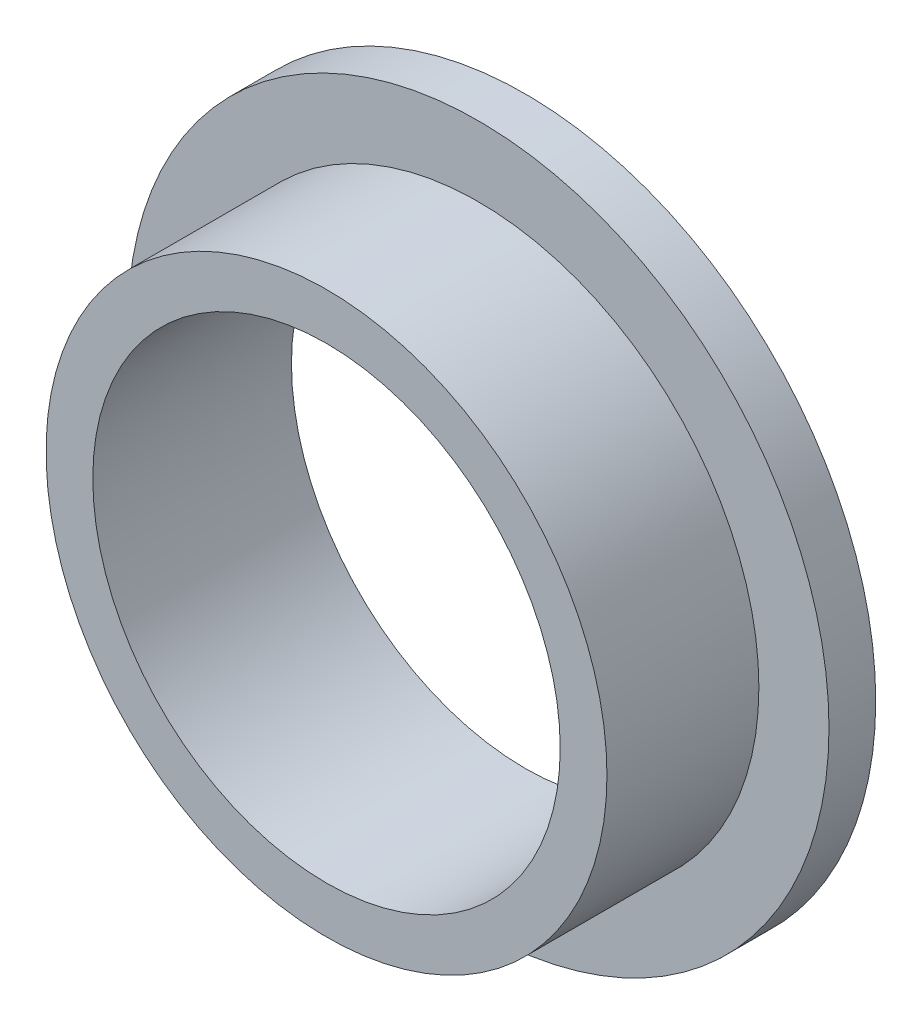
ISO-10303-21;
HEADER;
FILE_DESCRIPTION(('STEP AP214'),'2;1');
FILE_NAME('part.step','',(''),(''),'','','');
FILE_SCHEMA(('AUTOMOTIVE_DESIGN { 1 0 10303 214 1 1 1 1 }'));
ENDSEC;
DATA;
#1=APPLICATION_CONTEXT('core data for automotive mechanical design processes');
#2=APPLICATION_PROTOCOL_DEFINITION('international standard','automotive_design',2000,#1);
#3=PRODUCT_CONTEXT('',#1,'mechanical');
#4=PRODUCT('Part','Part','',(#3));
#5=PRODUCT_RELATED_PRODUCT_CATEGORY('part','',(#4));
#6=PRODUCT_DEFINITION_FORMATION('','',#4);
#7=PRODUCT_DEFINITION_CONTEXT('part definition',#1,'design');
#8=PRODUCT_DEFINITION('design','',#6,#7);
#9=PRODUCT_DEFINITION_SHAPE('','',#8);
#10=(LENGTH_UNIT() NAMED_UNIT(*) SI_UNIT(.MILLI.,.METRE.));
#11=(NAMED_UNIT(*) PLANE_ANGLE_UNIT() SI_UNIT($,.RADIAN.));
#12=(NAMED_UNIT(*) SI_UNIT($,.STERADIAN.) SOLID_ANGLE_UNIT());
#13=UNCERTAINTY_MEASURE_WITH_UNIT(LENGTH_MEASURE(1.E-05),#10,'distance_accuracy_value','');
#14=(GEOMETRIC_REPRESENTATION_CONTEXT(3) GLOBAL_UNCERTAINTY_ASSIGNED_CONTEXT((#13)) GLOBAL_UNIT_ASSIGNED_CONTEXT((#10,
#11,#12)) REPRESENTATION_CONTEXT('',''));
#15=CARTESIAN_POINT('',(0.,0.,0.));
#16=DIRECTION('',(0.,0.,1.));
#17=DIRECTION('',(1.,0.,0.));
#18=AXIS2_PLACEMENT_3D('',#15,#16,#17);
#19=CARTESIAN_POINT('',(0.,30.,0.));
#20=DIRECTION('',(0.,0.,1.));
#21=DIRECTION('',(1.,0.,0.));
#22=AXIS2_PLACEMENT_3D('',#19,#20,#21);
#23=PLANE('',#22);
#24=CARTESIAN_POINT('',(0.,0.,0.));
#25=DIRECTION('',(0.,0.,1.));
#26=DIRECTION('',(1.,0.,0.));
#27=AXIS2_PLACEMENT_3D('',#24,#25,#26);
#28=CIRCLE('',#27,45.);
#29=CARTESIAN_POINT('',(45.,0.,0.));
#30=VERTEX_POINT('',#29);
#31=EDGE_CURVE('E55',#30,#30,#28,.T.);
#32=ORIENTED_EDGE('',*,*,#31,.F.);
#33=EDGE_LOOP('',(#32));
#34=FACE_BOUND('',#33,.T.);
#35=CARTESIAN_POINT('',(0.,0.,0.));
#36=DIRECTION('',(0.,0.,1.));
#37=DIRECTION('',(1.,0.,0.));
#38=AXIS2_PLACEMENT_3D('',#35,#36,#37);
#39=CIRCLE('',#38,30.);
#40=CARTESIAN_POINT('',(30.,0.,0.));
#41=VERTEX_POINT('',#40);
#42=EDGE_CURVE('E10',#41,#41,#39,.T.);
#43=ORIENTED_EDGE('',*,*,#42,.T.);
#44=EDGE_LOOP('',(#43));
#45=FACE_BOUND('',#44,.T.);
#46=ADVANCED_FACE('F33',(#34,#45),#23,.F.);
#47=CARTESIAN_POINT('',(0.,0.,30.7627118644068));
#48=DIRECTION('',(0.,0.,1.));
#49=DIRECTION('',(1.,0.,0.));
#50=AXIS2_PLACEMENT_3D('',#47,#48,#49);
#51=CYLINDRICAL_SURFACE('',#50,30.);
#52=ORIENTED_EDGE('',*,*,#42,.F.);
#53=EDGE_LOOP('',(#52));
#54=FACE_BOUND('',#53,.T.);
#55=CARTESIAN_POINT('',(0.,0.,25.5));
#56=DIRECTION('',(0.,0.,1.));
#57=DIRECTION('',(1.,0.,0.));
#58=AXIS2_PLACEMENT_3D('',#55,#56,#57);
#59=CIRCLE('',#58,30.);
#60=CARTESIAN_POINT('',(30.,0.,25.5));
#61=VERTEX_POINT('',#60);
#62=EDGE_CURVE('E39',#61,#61,#59,.T.);
#63=ORIENTED_EDGE('',*,*,#62,.T.);
#64=EDGE_LOOP('',(#63));
#65=FACE_BOUND('',#64,.T.);
#66=ADVANCED_FACE('F62',(#54,#65),#51,.F.);
#67=CARTESIAN_POINT('',(0.,36.,25.5));
#68=DIRECTION('',(0.,0.,-1.));
#69=DIRECTION('',(-1.,0.,0.));
#70=AXIS2_PLACEMENT_3D('',#67,#68,#69);
#71=PLANE('',#70);
#72=ORIENTED_EDGE('',*,*,#62,.F.);
#73=EDGE_LOOP('',(#72));
#74=FACE_BOUND('',#73,.T.);
#75=CARTESIAN_POINT('',(0.,0.,25.5));
#76=DIRECTION('',(0.,0.,1.));
#77=DIRECTION('',(1.,0.,0.));
#78=AXIS2_PLACEMENT_3D('',#75,#76,#77);
#79=CIRCLE('',#78,36.);
#80=CARTESIAN_POINT('',(36.,0.,25.5));
#81=VERTEX_POINT('',#80);
#82=EDGE_CURVE('E43',#81,#81,#79,.T.);
#83=ORIENTED_EDGE('',*,*,#82,.T.);
#84=EDGE_LOOP('',(#83));
#85=FACE_BOUND('',#84,.T.);
#86=ADVANCED_FACE('F66',(#74,#85),#71,.F.);
#87=CARTESIAN_POINT('',(0.,0.,30.7627118644068));
#88=DIRECTION('',(0.,0.,1.));
#89=DIRECTION('',(1.,0.,0.));
#90=AXIS2_PLACEMENT_3D('',#87,#88,#89);
#91=CYLINDRICAL_SURFACE('',#90,36.);
#92=ORIENTED_EDGE('',*,*,#82,.F.);
#93=EDGE_LOOP('',(#92));
#94=FACE_BOUND('',#93,.T.);
#95=CARTESIAN_POINT('',(0.,0.,6.));
#96=DIRECTION('',(0.,0.,1.));
#97=DIRECTION('',(1.,0.,0.));
#98=AXIS2_PLACEMENT_3D('',#95,#96,#97);
#99=CIRCLE('',#98,36.);
#100=CARTESIAN_POINT('',(36.,0.,6.));
#101=VERTEX_POINT('',#100);
#102=EDGE_CURVE('E47',#101,#101,#99,.T.);
#103=ORIENTED_EDGE('',*,*,#102,.T.);
#104=EDGE_LOOP('',(#103));
#105=FACE_BOUND('',#104,.T.);
#106=ADVANCED_FACE('F71',(#94,#105),#91,.T.);
#107=CARTESIAN_POINT('',(0.,36.,6.));
#108=DIRECTION('',(0.,0.,-1.));
#109=DIRECTION('',(-1.,0.,0.));
#110=AXIS2_PLACEMENT_3D('',#107,#108,#109);
#111=PLANE('',#110);
#112=ORIENTED_EDGE('',*,*,#102,.F.);
#113=EDGE_LOOP('',(#112));
#114=FACE_BOUND('',#113,.T.);
#115=CARTESIAN_POINT('',(0.,0.,6.));
#116=DIRECTION('',(0.,0.,1.));
#117=DIRECTION('',(1.,0.,0.));
#118=AXIS2_PLACEMENT_3D('',#115,#116,#117);
#119=CIRCLE('',#118,45.);
#120=CARTESIAN_POINT('',(45.,0.,6.));
#121=VERTEX_POINT('',#120);
#122=EDGE_CURVE('E52',#121,#121,#119,.T.);
#123=ORIENTED_EDGE('',*,*,#122,.T.);
#124=EDGE_LOOP('',(#123));
#125=FACE_BOUND('',#124,.T.);
#126=ADVANCED_FACE('F77',(#114,#125),#111,.F.);
#127=CARTESIAN_POINT('',(0.,0.,30.7627118644068));
#128=DIRECTION('',(0.,0.,1.));
#129=DIRECTION('',(1.,0.,0.));
#130=AXIS2_PLACEMENT_3D('',#127,#128,#129);
#131=CYLINDRICAL_SURFACE('',#130,45.);
#132=ORIENTED_EDGE('',*,*,#122,.F.);
#133=EDGE_LOOP('',(#132));
#134=FACE_BOUND('',#133,.T.);
#135=ORIENTED_EDGE('',*,*,#31,.T.);
#136=EDGE_LOOP('',(#135));
#137=FACE_BOUND('',#136,.T.);
#138=ADVANCED_FACE('F59',(#134,#137),#131,.T.);
#139=CLOSED_SHELL('',(#46,#66,#86,#106,#126,#138));
#140=MANIFOLD_SOLID_BREP('B2',#139);
#141=ADVANCED_BREP_SHAPE_REPRESENTATION('',(#18,#140),#14);
#142=SHAPE_DEFINITION_REPRESENTATION(#9,#141);
ENDSEC;
END-ISO-10303-21;
